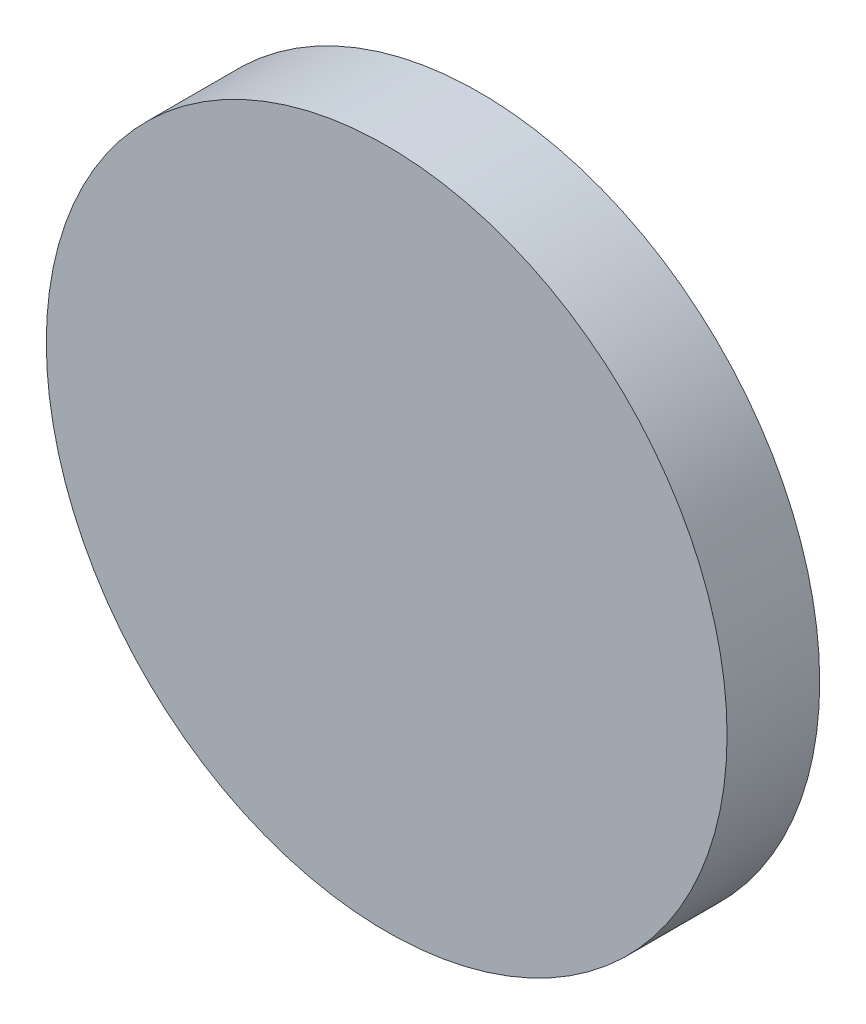
ISO-10303-21;
HEADER;
FILE_DESCRIPTION(('STEP AP214'),'2;1');
FILE_NAME('part.step','',(''),(''),'','','');
FILE_SCHEMA(('AUTOMOTIVE_DESIGN { 1 0 10303 214 1 1 1 1 }'));
ENDSEC;
DATA;
#1=APPLICATION_CONTEXT('core data for automotive mechanical design processes');
#2=APPLICATION_PROTOCOL_DEFINITION('international standard','automotive_design',2000,#1);
#3=PRODUCT_CONTEXT('',#1,'mechanical');
#4=PRODUCT('Part','Part','',(#3));
#5=PRODUCT_RELATED_PRODUCT_CATEGORY('part','',(#4));
#6=PRODUCT_DEFINITION_FORMATION('','',#4);
#7=PRODUCT_DEFINITION_CONTEXT('part definition',#1,'design');
#8=PRODUCT_DEFINITION('design','',#6,#7);
#9=PRODUCT_DEFINITION_SHAPE('','',#8);
#10=(LENGTH_UNIT() NAMED_UNIT(*) SI_UNIT(.MILLI.,.METRE.));
#11=(NAMED_UNIT(*) PLANE_ANGLE_UNIT() SI_UNIT($,.RADIAN.));
#12=(NAMED_UNIT(*) SI_UNIT($,.STERADIAN.) SOLID_ANGLE_UNIT());
#13=UNCERTAINTY_MEASURE_WITH_UNIT(LENGTH_MEASURE(1.E-05),#10,'distance_accuracy_value','');
#14=(GEOMETRIC_REPRESENTATION_CONTEXT(3) GLOBAL_UNCERTAINTY_ASSIGNED_CONTEXT((#13)) GLOBAL_UNIT_ASSIGNED_CONTEXT((#10,
#11,#12)) REPRESENTATION_CONTEXT('',''));
#15=CARTESIAN_POINT('',(0.,0.,0.));
#16=DIRECTION('',(0.,0.,1.));
#17=DIRECTION('',(1.,0.,0.));
#18=AXIS2_PLACEMENT_3D('',#15,#16,#17);
#19=CARTESIAN_POINT('',(0.,0.,0.));
#20=DIRECTION('',(0.,0.,1.));
#21=DIRECTION('',(1.,0.,0.));
#22=AXIS2_PLACEMENT_3D('',#19,#20,#21);
#23=PLANE('',#22);
#24=CARTESIAN_POINT('',(0.,0.,0.));
#25=DIRECTION('',(0.,0.,1.));
#26=DIRECTION('',(1.,0.,0.));
#27=AXIS2_PLACEMENT_3D('',#24,#25,#26);
#28=CIRCLE('',#27,3.675);
#29=CARTESIAN_POINT('',(3.675,0.,0.));
#30=VERTEX_POINT('',#29);
#31=EDGE_CURVE('E17',#30,#30,#28,.T.);
#32=ORIENTED_EDGE('',*,*,#31,.F.);
#33=EDGE_LOOP('',(#32));
#34=FACE_BOUND('',#33,.T.);
#35=ADVANCED_FACE('F14',(#34),#23,.F.);
#36=CARTESIAN_POINT('',(0.,0.,0.));
#37=DIRECTION('',(0.,0.,1.));
#38=DIRECTION('',(1.,0.,0.));
#39=AXIS2_PLACEMENT_3D('',#36,#37,#38);
#40=CYLINDRICAL_SURFACE('',#39,3.675);
#41=ORIENTED_EDGE('',*,*,#31,.T.);
#42=EDGE_LOOP('',(#41));
#43=FACE_BOUND('',#42,.T.);
#44=CARTESIAN_POINT('',(0.,0.,1.));
#45=DIRECTION('',(0.,0.,1.));
#46=DIRECTION('',(1.,0.,0.));
#47=AXIS2_PLACEMENT_3D('',#44,#45,#46);
#48=CIRCLE('',#47,3.675);
#49=CARTESIAN_POINT('',(3.675,0.,1.));
#50=VERTEX_POINT('',#49);
#51=EDGE_CURVE('E9',#50,#50,#48,.T.);
#52=ORIENTED_EDGE('',*,*,#51,.F.);
#53=EDGE_LOOP('',(#52));
#54=FACE_BOUND('',#53,.T.);
#55=ADVANCED_FACE('F26',(#43,#54),#40,.T.);
#56=CARTESIAN_POINT('',(0.,0.,1.));
#57=DIRECTION('',(0.,0.,1.));
#58=DIRECTION('',(1.,0.,0.));
#59=AXIS2_PLACEMENT_3D('',#56,#57,#58);
#60=PLANE('',#59);
#61=ORIENTED_EDGE('',*,*,#51,.T.);
#62=EDGE_LOOP('',(#61));
#63=FACE_BOUND('',#62,.T.);
#64=ADVANCED_FACE('F34',(#63),#60,.T.);
#65=CLOSED_SHELL('',(#35,#55,#64));
#66=MANIFOLD_SOLID_BREP('B1',#65);
#67=ADVANCED_BREP_SHAPE_REPRESENTATION('',(#18,#66),#14);
#68=SHAPE_DEFINITION_REPRESENTATION(#9,#67);
ENDSEC;
END-ISO-10303-21;
